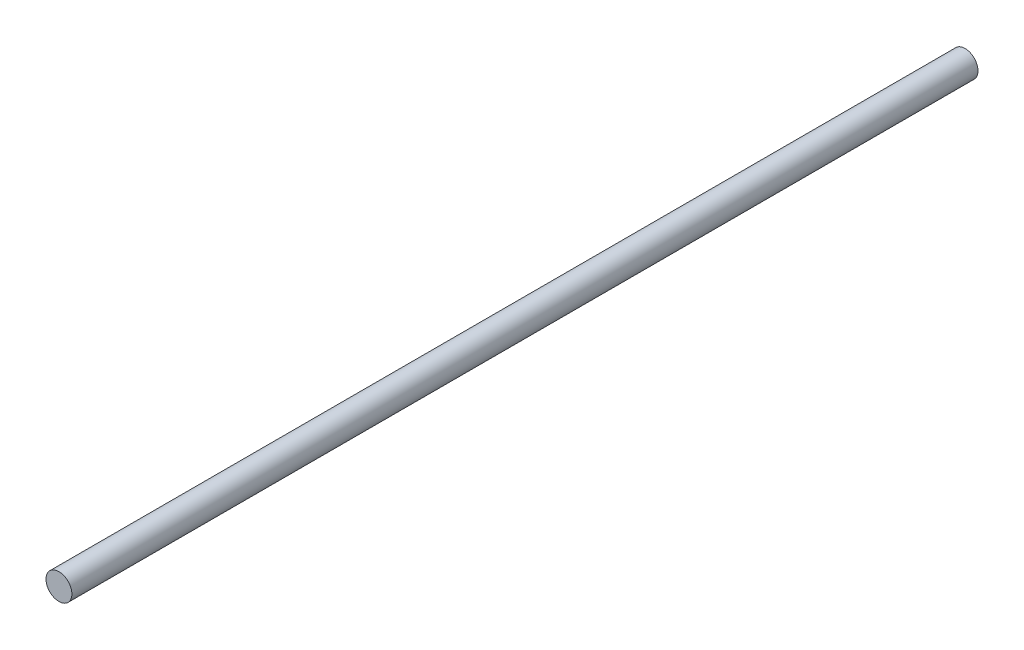
ISO-10303-21;
HEADER;
FILE_DESCRIPTION(('STEP AP214'),'2;1');
FILE_NAME('part.step','',(''),(''),'','','');
FILE_SCHEMA(('AUTOMOTIVE_DESIGN { 1 0 10303 214 1 1 1 1 }'));
ENDSEC;
DATA;
#1=APPLICATION_CONTEXT('core data for automotive mechanical design processes');
#2=APPLICATION_PROTOCOL_DEFINITION('international standard','automotive_design',2000,#1);
#3=PRODUCT_CONTEXT('',#1,'mechanical');
#4=PRODUCT('Part','Part','',(#3));
#5=PRODUCT_RELATED_PRODUCT_CATEGORY('part','',(#4));
#6=PRODUCT_DEFINITION_FORMATION('','',#4);
#7=PRODUCT_DEFINITION_CONTEXT('part definition',#1,'design');
#8=PRODUCT_DEFINITION('design','',#6,#7);
#9=PRODUCT_DEFINITION_SHAPE('','',#8);
#10=(LENGTH_UNIT() NAMED_UNIT(*) SI_UNIT(.MILLI.,.METRE.));
#11=(NAMED_UNIT(*) PLANE_ANGLE_UNIT() SI_UNIT($,.RADIAN.));
#12=(NAMED_UNIT(*) SI_UNIT($,.STERADIAN.) SOLID_ANGLE_UNIT());
#13=UNCERTAINTY_MEASURE_WITH_UNIT(LENGTH_MEASURE(1.E-05),#10,'distance_accuracy_value','');
#14=(GEOMETRIC_REPRESENTATION_CONTEXT(3) GLOBAL_UNCERTAINTY_ASSIGNED_CONTEXT((#13)) GLOBAL_UNIT_ASSIGNED_CONTEXT((#10,
#11,#12)) REPRESENTATION_CONTEXT('',''));
#15=CARTESIAN_POINT('',(0.,0.,0.));
#16=DIRECTION('',(0.,0.,1.));
#17=DIRECTION('',(1.,0.,0.));
#18=AXIS2_PLACEMENT_3D('',#15,#16,#17);
#19=CARTESIAN_POINT('',(0.,0.,280.));
#20=DIRECTION('',(0.,0.,-1.));
#21=DIRECTION('',(-1.,0.,0.));
#22=AXIS2_PLACEMENT_3D('',#19,#20,#21);
#23=CYLINDRICAL_SURFACE('',#22,4.);
#24=CARTESIAN_POINT('',(0.,0.,280.));
#25=DIRECTION('',(0.,0.,1.));
#26=DIRECTION('',(1.,0.,0.));
#27=AXIS2_PLACEMENT_3D('',#24,#25,#26);
#28=CIRCLE('',#27,4.);
#29=CARTESIAN_POINT('',(4.,0.,280.));
#30=VERTEX_POINT('',#29);
#31=EDGE_CURVE('E10',#30,#30,#28,.T.);
#32=ORIENTED_EDGE('',*,*,#31,.F.);
#33=EDGE_LOOP('',(#32));
#34=FACE_BOUND('',#33,.T.);
#35=CARTESIAN_POINT('',(0.,0.,0.));
#36=DIRECTION('',(0.,0.,1.));
#37=DIRECTION('',(1.,0.,0.));
#38=AXIS2_PLACEMENT_3D('',#35,#36,#37);
#39=CIRCLE('',#38,4.);
#40=CARTESIAN_POINT('',(4.,0.,0.));
#41=VERTEX_POINT('',#40);
#42=EDGE_CURVE('E34',#41,#41,#39,.T.);
#43=ORIENTED_EDGE('',*,*,#42,.T.);
#44=EDGE_LOOP('',(#43));
#45=FACE_BOUND('',#44,.T.);
#46=ADVANCED_FACE('F31',(#34,#45),#23,.T.);
#47=CARTESIAN_POINT('',(0.,0.,280.));
#48=DIRECTION('',(0.,0.,1.));
#49=DIRECTION('',(1.,0.,0.));
#50=AXIS2_PLACEMENT_3D('',#47,#48,#49);
#51=PLANE('',#50);
#52=ORIENTED_EDGE('',*,*,#31,.T.);
#53=EDGE_LOOP('',(#52));
#54=FACE_BOUND('',#53,.T.);
#55=ADVANCED_FACE('F46',(#54),#51,.T.);
#56=CARTESIAN_POINT('',(0.,0.,0.));
#57=DIRECTION('',(0.,0.,1.));
#58=DIRECTION('',(1.,0.,0.));
#59=AXIS2_PLACEMENT_3D('',#56,#57,#58);
#60=PLANE('',#59);
#61=ORIENTED_EDGE('',*,*,#42,.F.);
#62=EDGE_LOOP('',(#61));
#63=FACE_BOUND('',#62,.T.);
#64=ADVANCED_FACE('F44',(#63),#60,.F.);
#65=CLOSED_SHELL('',(#46,#55,#64));
#66=MANIFOLD_SOLID_BREP('B2',#65);
#67=ADVANCED_BREP_SHAPE_REPRESENTATION('',(#18,#66),#14);
#68=SHAPE_DEFINITION_REPRESENTATION(#9,#67);
ENDSEC;
END-ISO-10303-21;
